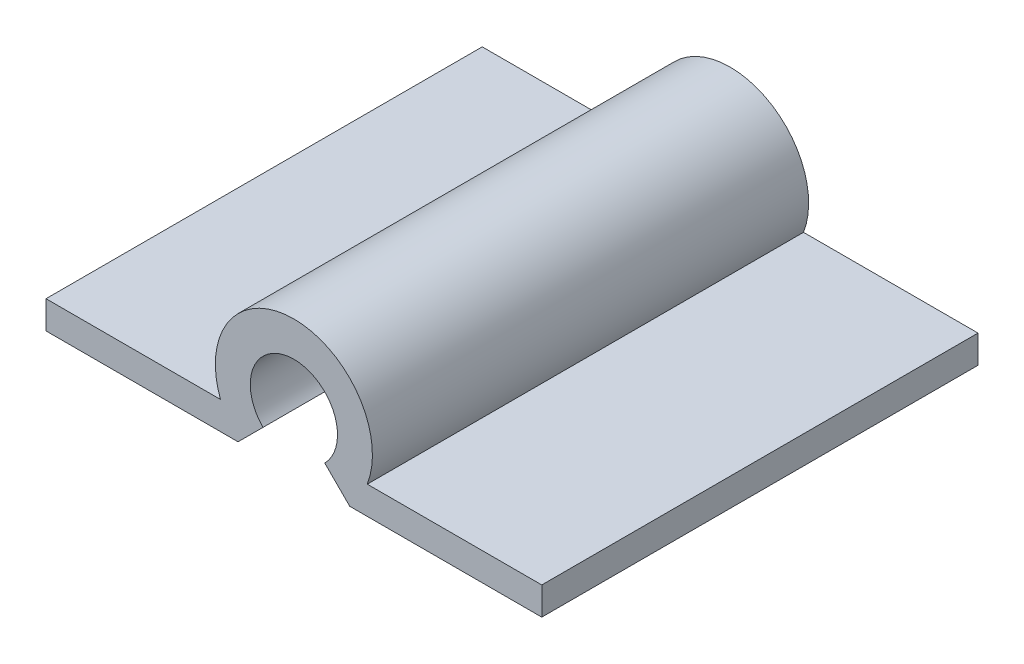
ISO-10303-21;
HEADER;
FILE_DESCRIPTION(('STEP AP214'),'2;1');
FILE_NAME('part.step','',(''),(''),'','','');
FILE_SCHEMA(('AUTOMOTIVE_DESIGN { 1 0 10303 214 1 1 1 1 }'));
ENDSEC;
DATA;
#1=APPLICATION_CONTEXT('core data for automotive mechanical design processes');
#2=APPLICATION_PROTOCOL_DEFINITION('international standard','automotive_design',2000,#1);
#3=PRODUCT_CONTEXT('',#1,'mechanical');
#4=PRODUCT('Part','Part','',(#3));
#5=PRODUCT_RELATED_PRODUCT_CATEGORY('part','',(#4));
#6=PRODUCT_DEFINITION_FORMATION('','',#4);
#7=PRODUCT_DEFINITION_CONTEXT('part definition',#1,'design');
#8=PRODUCT_DEFINITION('design','',#6,#7);
#9=PRODUCT_DEFINITION_SHAPE('','',#8);
#10=(LENGTH_UNIT() NAMED_UNIT(*) SI_UNIT(.MILLI.,.METRE.));
#11=(NAMED_UNIT(*) PLANE_ANGLE_UNIT() SI_UNIT($,.RADIAN.));
#12=(NAMED_UNIT(*) SI_UNIT($,.STERADIAN.) SOLID_ANGLE_UNIT());
#13=UNCERTAINTY_MEASURE_WITH_UNIT(LENGTH_MEASURE(1.E-05),#10,'distance_accuracy_value','');
#14=(GEOMETRIC_REPRESENTATION_CONTEXT(3) GLOBAL_UNCERTAINTY_ASSIGNED_CONTEXT((#13)) GLOBAL_UNIT_ASSIGNED_CONTEXT((#10,
#11,#12)) REPRESENTATION_CONTEXT('',''));
#15=CARTESIAN_POINT('',(0.,0.,0.));
#16=DIRECTION('',(0.,0.,1.));
#17=DIRECTION('',(1.,0.,0.));
#18=AXIS2_PLACEMENT_3D('',#15,#16,#17);
#19=CARTESIAN_POINT('',(0.,0.,15.875));
#20=DIRECTION('',(0.,0.,-1.));
#21=DIRECTION('',(-1.,0.,0.));
#22=AXIS2_PLACEMENT_3D('',#19,#20,#21);
#23=CYLINDRICAL_SURFACE('',#22,2.8575);
#24=CARTESIAN_POINT('',(0.,0.,0.));
#25=DIRECTION('',(0.,0.,1.));
#26=DIRECTION('',(1.,0.,0.));
#27=AXIS2_PLACEMENT_3D('',#24,#25,#26);
#28=CIRCLE('',#27,2.8575);
#29=CARTESIAN_POINT('',(2.67077708729126,-1.016,0.));
#30=VERTEX_POINT('',#29);
#31=CARTESIAN_POINT('',(-2.67077708729126,-1.016,0.));
#32=VERTEX_POINT('',#31);
#33=EDGE_CURVE('E142',#30,#32,#28,.T.);
#34=ORIENTED_EDGE('',*,*,#33,.T.);
#35=DIRECTION('',(0.,0.,-1.));
#36=VECTOR('',#35,1.);
#37=CARTESIAN_POINT('',(-2.67077708729126,-1.016,15.875));
#38=LINE('',#37,#36);
#39=CARTESIAN_POINT('',(-2.67077708729126,-1.016,15.875));
#40=VERTEX_POINT('',#39);
#41=EDGE_CURVE('E11',#40,#32,#38,.T.);
#42=ORIENTED_EDGE('',*,*,#41,.F.);
#43=CARTESIAN_POINT('',(0.,0.,15.875));
#44=DIRECTION('',(0.,0.,1.));
#45=DIRECTION('',(1.,0.,0.));
#46=AXIS2_PLACEMENT_3D('',#43,#44,#45);
#47=CIRCLE('',#46,2.8575);
#48=CARTESIAN_POINT('',(2.67077708729126,-1.016,15.875));
#49=VERTEX_POINT('',#48);
#50=EDGE_CURVE('E165',#49,#40,#47,.T.);
#51=ORIENTED_EDGE('',*,*,#50,.F.);
#52=DIRECTION('',(0.,0.,-1.));
#53=VECTOR('',#52,1.);
#54=CARTESIAN_POINT('',(2.67077708729126,-1.016,15.875));
#55=LINE('',#54,#53);
#56=EDGE_CURVE('E49',#49,#30,#55,.T.);
#57=ORIENTED_EDGE('',*,*,#56,.T.);
#58=EDGE_LOOP('',(#34,#42,#51,#57));
#59=FACE_BOUND('',#58,.T.);
#60=ADVANCED_FACE('F33',(#59),#23,.T.);
#61=CARTESIAN_POINT('',(-2.67077708729126,-1.016,15.875));
#62=DIRECTION('',(0.,-1.,0.));
#63=DIRECTION('',(1.,0.,0.));
#64=AXIS2_PLACEMENT_3D('',#61,#62,#63);
#65=PLANE('',#64);
#66=DIRECTION('',(-1.,0.,0.));
#67=VECTOR('',#66,1.);
#68=CARTESIAN_POINT('',(-2.67077708729126,-1.016,0.));
#69=LINE('',#68,#67);
#70=CARTESIAN_POINT('',(-9.02077708729126,-1.016,0.));
#71=VERTEX_POINT('',#70);
#72=EDGE_CURVE('E144',#32,#71,#69,.T.);
#73=ORIENTED_EDGE('',*,*,#72,.T.);
#74=DIRECTION('',(0.,0.,-1.));
#75=VECTOR('',#74,1.);
#76=CARTESIAN_POINT('',(-9.02077708729126,-1.016,15.875));
#77=LINE('',#76,#75);
#78=CARTESIAN_POINT('',(-9.02077708729126,-1.016,15.875));
#79=VERTEX_POINT('',#78);
#80=EDGE_CURVE('E41',#79,#71,#77,.T.);
#81=ORIENTED_EDGE('',*,*,#80,.F.);
#82=DIRECTION('',(-1.,0.,0.));
#83=VECTOR('',#82,1.);
#84=CARTESIAN_POINT('',(-2.67077708729126,-1.016,15.875));
#85=LINE('',#84,#83);
#86=EDGE_CURVE('E93',#40,#79,#85,.T.);
#87=ORIENTED_EDGE('',*,*,#86,.F.);
#88=ORIENTED_EDGE('',*,*,#41,.T.);
#89=EDGE_LOOP('',(#73,#81,#87,#88));
#90=FACE_BOUND('',#89,.T.);
#91=ADVANCED_FACE('F220',(#90),#65,.F.);
#92=CARTESIAN_POINT('',(-9.02077708729126,-1.016,15.875));
#93=DIRECTION('',(1.,0.,0.));
#94=DIRECTION('',(0.,0.,-1.));
#95=AXIS2_PLACEMENT_3D('',#92,#93,#94);
#96=PLANE('',#95);
#97=DIRECTION('',(0.,-1.,0.));
#98=VECTOR('',#97,1.);
#99=CARTESIAN_POINT('',(-9.02077708729126,-1.016,0.));
#100=LINE('',#99,#98);
#101=CARTESIAN_POINT('',(-9.02077708729126,-2.032,0.));
#102=VERTEX_POINT('',#101);
#103=EDGE_CURVE('E146',#71,#102,#100,.T.);
#104=ORIENTED_EDGE('',*,*,#103,.T.);
#105=DIRECTION('',(0.,0.,-1.));
#106=VECTOR('',#105,1.);
#107=CARTESIAN_POINT('',(-9.02077708729126,-2.032,15.875));
#108=LINE('',#107,#106);
#109=CARTESIAN_POINT('',(-9.02077708729126,-2.032,15.875));
#110=VERTEX_POINT('',#109);
#111=EDGE_CURVE('E176',#110,#102,#108,.T.);
#112=ORIENTED_EDGE('',*,*,#111,.F.);
#113=DIRECTION('',(0.,-1.,0.));
#114=VECTOR('',#113,1.);
#115=CARTESIAN_POINT('',(-9.02077708729126,-1.016,15.875));
#116=LINE('',#115,#114);
#117=EDGE_CURVE('E184',#79,#110,#116,.T.);
#118=ORIENTED_EDGE('',*,*,#117,.F.);
#119=ORIENTED_EDGE('',*,*,#80,.T.);
#120=EDGE_LOOP('',(#104,#112,#118,#119));
#121=FACE_BOUND('',#120,.T.);
#122=ADVANCED_FACE('F182',(#121),#96,.F.);
#123=CARTESIAN_POINT('',(-9.02077708729126,-2.032,15.875));
#124=DIRECTION('',(0.,1.,0.));
#125=DIRECTION('',(-1.,0.,0.));
#126=AXIS2_PLACEMENT_3D('',#123,#124,#125);
#127=PLANE('',#126);
#128=DIRECTION('',(1.,0.,0.));
#129=VECTOR('',#128,1.);
#130=CARTESIAN_POINT('',(-9.02077708729126,-2.032,0.));
#131=LINE('',#130,#129);
#132=CARTESIAN_POINT('',(-2.03199999999999,-2.032,0.));
#133=VERTEX_POINT('',#132);
#134=EDGE_CURVE('E148',#102,#133,#131,.T.);
#135=ORIENTED_EDGE('',*,*,#134,.T.);
#136=DIRECTION('',(0.,0.,-1.));
#137=VECTOR('',#136,1.);
#138=CARTESIAN_POINT('',(-2.03199999999999,-2.032,15.875));
#139=LINE('',#138,#137);
#140=CARTESIAN_POINT('',(-2.03199999999999,-2.032,15.875));
#141=VERTEX_POINT('',#140);
#142=EDGE_CURVE('E173',#141,#133,#139,.T.);
#143=ORIENTED_EDGE('',*,*,#142,.F.);
#144=DIRECTION('',(1.,0.,0.));
#145=VECTOR('',#144,1.);
#146=CARTESIAN_POINT('',(-9.02077708729126,-2.032,15.875));
#147=LINE('',#146,#145);
#148=EDGE_CURVE('E200',#110,#141,#147,.T.);
#149=ORIENTED_EDGE('',*,*,#148,.F.);
#150=ORIENTED_EDGE('',*,*,#111,.T.);
#151=EDGE_LOOP('',(#135,#143,#149,#150));
#152=FACE_BOUND('',#151,.T.);
#153=ADVANCED_FACE('F191',(#152),#127,.F.);
#154=CARTESIAN_POINT('',(-2.03199999999999,-2.032,15.875));
#155=DIRECTION('',(-0.70710678118655,0.707106781186545,0.));
#156=DIRECTION('',(-0.707106781186545,-0.70710678118655,0.));
#157=AXIS2_PLACEMENT_3D('',#154,#155,#156);
#158=PLANE('',#157);
#159=DIRECTION('',(0.707106781186545,0.707106781186549,0.));
#160=VECTOR('',#159,1.);
#161=CARTESIAN_POINT('',(-2.03199999999999,-2.032,0.));
#162=LINE('',#161,#160);
#163=CARTESIAN_POINT('',(-1.12253201513364,-1.12253201513365,0.));
#164=VERTEX_POINT('',#163);
#165=EDGE_CURVE('E150',#133,#164,#162,.T.);
#166=ORIENTED_EDGE('',*,*,#165,.T.);
#167=DIRECTION('',(0.,0.,-1.));
#168=VECTOR('',#167,1.);
#169=CARTESIAN_POINT('',(-1.12253201513364,-1.12253201513365,15.875));
#170=LINE('',#169,#168);
#171=CARTESIAN_POINT('',(-1.12253201513364,-1.12253201513365,15.875));
#172=VERTEX_POINT('',#171);
#173=EDGE_CURVE('E171',#172,#164,#170,.T.);
#174=ORIENTED_EDGE('',*,*,#173,.F.);
#175=DIRECTION('',(0.707106781186545,0.707106781186549,0.));
#176=VECTOR('',#175,1.);
#177=CARTESIAN_POINT('',(-2.03199999999999,-2.032,15.875));
#178=LINE('',#177,#176);
#179=EDGE_CURVE('E197',#141,#172,#178,.T.);
#180=ORIENTED_EDGE('',*,*,#179,.F.);
#181=ORIENTED_EDGE('',*,*,#142,.T.);
#182=EDGE_LOOP('',(#166,#174,#180,#181));
#183=FACE_BOUND('',#182,.T.);
#184=ADVANCED_FACE('F195',(#183),#158,.F.);
#185=CARTESIAN_POINT('',(0.,0.,15.875));
#186=DIRECTION('',(0.,0.,-1.));
#187=DIRECTION('',(-1.,0.,0.));
#188=AXIS2_PLACEMENT_3D('',#185,#186,#187);
#189=CYLINDRICAL_SURFACE('',#188,1.5875);
#190=CARTESIAN_POINT('',(0.,0.,0.));
#191=DIRECTION('',(0.,0.,1.));
#192=DIRECTION('',(1.,0.,0.));
#193=AXIS2_PLACEMENT_3D('',#190,#191,#192);
#194=CIRCLE('',#193,1.5875);
#195=CARTESIAN_POINT('',(1.12253201513365,-1.12253201513364,0.));
#196=VERTEX_POINT('',#195);
#197=EDGE_CURVE('E153',#196,#164,#194,.T.);
#198=ORIENTED_EDGE('',*,*,#197,.F.);
#199=DIRECTION('',(0.,0.,-1.));
#200=VECTOR('',#199,1.);
#201=CARTESIAN_POINT('',(1.12253201513365,-1.12253201513364,15.875));
#202=LINE('',#201,#200);
#203=CARTESIAN_POINT('',(1.12253201513365,-1.12253201513364,15.875));
#204=VERTEX_POINT('',#203);
#205=EDGE_CURVE('E169',#204,#196,#202,.T.);
#206=ORIENTED_EDGE('',*,*,#205,.F.);
#207=CARTESIAN_POINT('',(0.,0.,15.875));
#208=DIRECTION('',(0.,0.,1.));
#209=DIRECTION('',(1.,0.,0.));
#210=AXIS2_PLACEMENT_3D('',#207,#208,#209);
#211=CIRCLE('',#210,1.5875);
#212=EDGE_CURVE('E199',#204,#172,#211,.T.);
#213=ORIENTED_EDGE('',*,*,#212,.T.);
#214=ORIENTED_EDGE('',*,*,#173,.T.);
#215=EDGE_LOOP('',(#198,#206,#213,#214));
#216=FACE_BOUND('',#215,.T.);
#217=ADVANCED_FACE('F236',(#216),#189,.F.);
#218=CARTESIAN_POINT('',(2.03200000000002,-2.032,15.875));
#219=DIRECTION('',(-0.707106781186544,-0.707106781186551,0.));
#220=DIRECTION('',(0.707106781186551,-0.707106781186544,0.));
#221=AXIS2_PLACEMENT_3D('',#218,#219,#220);
#222=PLANE('',#221);
#223=DIRECTION('',(-0.707106781186551,0.707106781186544,0.));
#224=VECTOR('',#223,1.);
#225=CARTESIAN_POINT('',(2.03200000000002,-2.032,0.));
#226=LINE('',#225,#224);
#227=CARTESIAN_POINT('',(2.03200000000002,-2.032,0.));
#228=VERTEX_POINT('',#227);
#229=EDGE_CURVE('E156',#228,#196,#226,.T.);
#230=ORIENTED_EDGE('',*,*,#229,.F.);
#231=DIRECTION('',(0.,0.,-1.));
#232=VECTOR('',#231,1.);
#233=CARTESIAN_POINT('',(2.03200000000002,-2.032,15.875));
#234=LINE('',#233,#232);
#235=CARTESIAN_POINT('',(2.03200000000002,-2.032,15.875));
#236=VERTEX_POINT('',#235);
#237=EDGE_CURVE('E134',#236,#228,#234,.T.);
#238=ORIENTED_EDGE('',*,*,#237,.F.);
#239=DIRECTION('',(-0.707106781186551,0.707106781186544,0.));
#240=VECTOR('',#239,1.);
#241=CARTESIAN_POINT('',(2.03200000000002,-2.032,15.875));
#242=LINE('',#241,#240);
#243=EDGE_CURVE('E124',#236,#204,#242,.T.);
#244=ORIENTED_EDGE('',*,*,#243,.T.);
#245=ORIENTED_EDGE('',*,*,#205,.T.);
#246=EDGE_LOOP('',(#230,#238,#244,#245));
#247=FACE_BOUND('',#246,.T.);
#248=ADVANCED_FACE('F207',(#247),#222,.T.);
#249=CARTESIAN_POINT('',(2.03200000000002,-2.032,15.875));
#250=DIRECTION('',(0.,1.,0.));
#251=DIRECTION('',(-1.,0.,0.));
#252=AXIS2_PLACEMENT_3D('',#249,#250,#251);
#253=PLANE('',#252);
#254=DIRECTION('',(1.,0.,0.));
#255=VECTOR('',#254,1.);
#256=CARTESIAN_POINT('',(2.03200000000002,-2.032,0.));
#257=LINE('',#256,#255);
#258=CARTESIAN_POINT('',(9.02077708729129,-2.032,0.));
#259=VERTEX_POINT('',#258);
#260=EDGE_CURVE('E131',#228,#259,#257,.T.);
#261=ORIENTED_EDGE('',*,*,#260,.T.);
#262=DIRECTION('',(0.,0.,-1.));
#263=VECTOR('',#262,1.);
#264=CARTESIAN_POINT('',(9.02077708729129,-2.032,15.875));
#265=LINE('',#264,#263);
#266=CARTESIAN_POINT('',(9.02077708729129,-2.032,15.875));
#267=VERTEX_POINT('',#266);
#268=EDGE_CURVE('E128',#267,#259,#265,.T.);
#269=ORIENTED_EDGE('',*,*,#268,.F.);
#270=DIRECTION('',(1.,0.,0.));
#271=VECTOR('',#270,1.);
#272=CARTESIAN_POINT('',(2.03200000000002,-2.032,15.875));
#273=LINE('',#272,#271);
#274=EDGE_CURVE('E116',#236,#267,#273,.T.);
#275=ORIENTED_EDGE('',*,*,#274,.F.);
#276=ORIENTED_EDGE('',*,*,#237,.T.);
#277=EDGE_LOOP('',(#261,#269,#275,#276));
#278=FACE_BOUND('',#277,.T.);
#279=ADVANCED_FACE('F129',(#278),#253,.F.);
#280=CARTESIAN_POINT('',(9.02077708729126,-1.016,15.875));
#281=DIRECTION('',(1.,0.,0.));
#282=DIRECTION('',(0.,1.,0.));
#283=AXIS2_PLACEMENT_3D('',#280,#281,#282);
#284=PLANE('',#283);
#285=DIRECTION('',(0.,-1.,0.));
#286=VECTOR('',#285,1.);
#287=CARTESIAN_POINT('',(9.02077708729126,-1.016,0.));
#288=LINE('',#287,#286);
#289=CARTESIAN_POINT('',(9.02077708729126,-1.016,0.));
#290=VERTEX_POINT('',#289);
#291=EDGE_CURVE('E160',#290,#259,#288,.T.);
#292=ORIENTED_EDGE('',*,*,#291,.F.);
#293=DIRECTION('',(0.,0.,-1.));
#294=VECTOR('',#293,1.);
#295=CARTESIAN_POINT('',(9.02077708729126,-1.016,15.875));
#296=LINE('',#295,#294);
#297=CARTESIAN_POINT('',(9.02077708729126,-1.016,15.875));
#298=VERTEX_POINT('',#297);
#299=EDGE_CURVE('E81',#298,#290,#296,.T.);
#300=ORIENTED_EDGE('',*,*,#299,.F.);
#301=DIRECTION('',(0.,-1.,0.));
#302=VECTOR('',#301,1.);
#303=CARTESIAN_POINT('',(9.02077708729126,-1.016,15.875));
#304=LINE('',#303,#302);
#305=EDGE_CURVE('E121',#298,#267,#304,.T.);
#306=ORIENTED_EDGE('',*,*,#305,.T.);
#307=ORIENTED_EDGE('',*,*,#268,.T.);
#308=EDGE_LOOP('',(#292,#300,#306,#307));
#309=FACE_BOUND('',#308,.T.);
#310=ADVANCED_FACE('F136',(#309),#284,.T.);
#311=CARTESIAN_POINT('',(2.67077708729126,-1.016,15.875));
#312=DIRECTION('',(0.,1.,0.));
#313=DIRECTION('',(-1.,0.,0.));
#314=AXIS2_PLACEMENT_3D('',#311,#312,#313);
#315=PLANE('',#314);
#316=DIRECTION('',(1.,0.,0.));
#317=VECTOR('',#316,1.);
#318=CARTESIAN_POINT('',(2.67077708729126,-1.016,0.));
#319=LINE('',#318,#317);
#320=EDGE_CURVE('E162',#30,#290,#319,.T.);
#321=ORIENTED_EDGE('',*,*,#320,.F.);
#322=ORIENTED_EDGE('',*,*,#56,.F.);
#323=DIRECTION('',(1.,0.,0.));
#324=VECTOR('',#323,1.);
#325=CARTESIAN_POINT('',(2.67077708729126,-1.016,15.875));
#326=LINE('',#325,#324);
#327=EDGE_CURVE('E137',#49,#298,#326,.T.);
#328=ORIENTED_EDGE('',*,*,#327,.T.);
#329=ORIENTED_EDGE('',*,*,#299,.T.);
#330=EDGE_LOOP('',(#321,#322,#328,#329));
#331=FACE_BOUND('',#330,.T.);
#332=ADVANCED_FACE('F209',(#331),#315,.T.);
#333=CARTESIAN_POINT('',(0.,0.,15.875));
#334=DIRECTION('',(0.,0.,1.));
#335=DIRECTION('',(1.,0.,0.));
#336=AXIS2_PLACEMENT_3D('',#333,#334,#335);
#337=PLANE('',#336);
#338=ORIENTED_EDGE('',*,*,#50,.T.);
#339=ORIENTED_EDGE('',*,*,#86,.T.);
#340=ORIENTED_EDGE('',*,*,#117,.T.);
#341=ORIENTED_EDGE('',*,*,#148,.T.);
#342=ORIENTED_EDGE('',*,*,#179,.T.);
#343=ORIENTED_EDGE('',*,*,#212,.F.);
#344=ORIENTED_EDGE('',*,*,#243,.F.);
#345=ORIENTED_EDGE('',*,*,#274,.T.);
#346=ORIENTED_EDGE('',*,*,#305,.F.);
#347=ORIENTED_EDGE('',*,*,#327,.F.);
#348=EDGE_LOOP('',(#338,#339,#340,#341,#342,#343,#344,#345,#346,#347));
#349=FACE_BOUND('',#348,.T.);
#350=ADVANCED_FACE('F118',(#349),#337,.T.);
#351=CARTESIAN_POINT('',(0.,0.,0.));
#352=DIRECTION('',(0.,0.,1.));
#353=DIRECTION('',(1.,0.,0.));
#354=AXIS2_PLACEMENT_3D('',#351,#352,#353);
#355=PLANE('',#354);
#356=ORIENTED_EDGE('',*,*,#33,.F.);
#357=ORIENTED_EDGE('',*,*,#320,.T.);
#358=ORIENTED_EDGE('',*,*,#291,.T.);
#359=ORIENTED_EDGE('',*,*,#260,.F.);
#360=ORIENTED_EDGE('',*,*,#229,.T.);
#361=ORIENTED_EDGE('',*,*,#197,.T.);
#362=ORIENTED_EDGE('',*,*,#165,.F.);
#363=ORIENTED_EDGE('',*,*,#134,.F.);
#364=ORIENTED_EDGE('',*,*,#103,.F.);
#365=ORIENTED_EDGE('',*,*,#72,.F.);
#366=EDGE_LOOP('',(#356,#357,#358,#359,#360,#361,#362,#363,#364,#365));
#367=FACE_BOUND('',#366,.T.);
#368=ADVANCED_FACE('F187',(#367),#355,.F.);
#369=CLOSED_SHELL('',(#60,#91,#122,#153,#184,#217,#248,#279,#310,#332,#350,#368));
#370=MANIFOLD_SOLID_BREP('B2',#369);
#371=ADVANCED_BREP_SHAPE_REPRESENTATION('',(#18,#370),#14);
#372=SHAPE_DEFINITION_REPRESENTATION(#9,#371);
ENDSEC;
END-ISO-10303-21;
